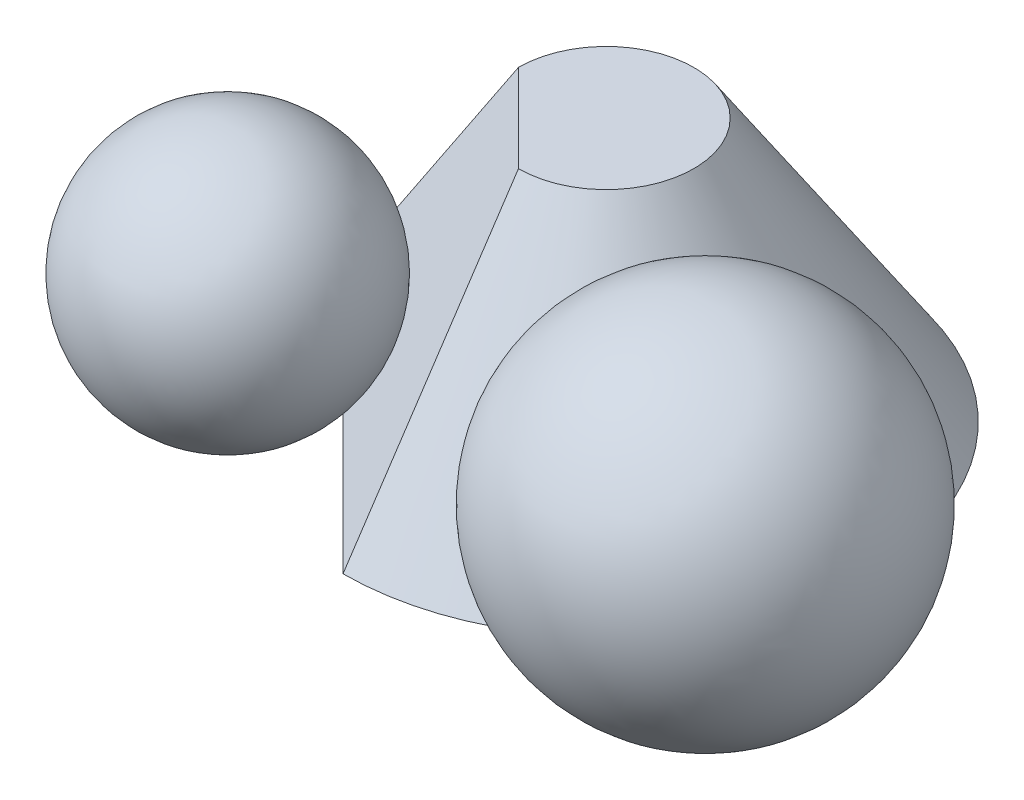
ISO-10303-21;
HEADER;
FILE_DESCRIPTION(('STEP AP214'),'2;1');
FILE_NAME('part.step','',(''),(''),'','','');
FILE_SCHEMA(('AUTOMOTIVE_DESIGN { 1 0 10303 214 1 1 1 1 }'));
ENDSEC;
DATA;
#1=APPLICATION_CONTEXT('core data for automotive mechanical design processes');
#2=APPLICATION_PROTOCOL_DEFINITION('international standard','automotive_design',2000,#1);
#3=PRODUCT_CONTEXT('',#1,'mechanical');
#4=PRODUCT('Part','Part','',(#3));
#5=PRODUCT_RELATED_PRODUCT_CATEGORY('part','',(#4));
#6=PRODUCT_DEFINITION_FORMATION('','',#4);
#7=PRODUCT_DEFINITION_CONTEXT('part definition',#1,'design');
#8=PRODUCT_DEFINITION('design','',#6,#7);
#9=PRODUCT_DEFINITION_SHAPE('','',#8);
#10=(LENGTH_UNIT() NAMED_UNIT(*) SI_UNIT(.MILLI.,.METRE.));
#11=(NAMED_UNIT(*) PLANE_ANGLE_UNIT() SI_UNIT($,.RADIAN.));
#12=(NAMED_UNIT(*) SI_UNIT($,.STERADIAN.) SOLID_ANGLE_UNIT());
#13=UNCERTAINTY_MEASURE_WITH_UNIT(LENGTH_MEASURE(1.E-05),#10,'distance_accuracy_value','');
#14=(GEOMETRIC_REPRESENTATION_CONTEXT(3) GLOBAL_UNCERTAINTY_ASSIGNED_CONTEXT((#13)) GLOBAL_UNIT_ASSIGNED_CONTEXT((#10,
#11,#12)) REPRESENTATION_CONTEXT('',''));
#15=CARTESIAN_POINT('',(0.,0.,0.));
#16=DIRECTION('',(0.,0.,1.));
#17=DIRECTION('',(1.,0.,0.));
#18=AXIS2_PLACEMENT_3D('',#15,#16,#17);
#19=CARTESIAN_POINT('',(50.8589941132433,30.1296581635736,33.9059960754955));
#20=DIRECTION('',(0.,1.,0.));
#21=DIRECTION('',(0.832050294337844,0.,0.554700196225229));
#22=AXIS2_PLACEMENT_3D('',#19,#20,#21);
#23=SPHERICAL_SURFACE('',#22,30.1296581635736);
#24=CARTESIAN_POINT('',(50.8589941132433,60.2593163271471,33.9059960754955));
#25=VERTEX_POINT('',#24);
#26=VERTEX_LOOP('',#25);
#27=FACE_BOUND('',#26,.T.);
#28=ADVANCED_FACE('F42',(#27),#23,.T.);
#29=CLOSED_SHELL('',(#28));
#30=MANIFOLD_SOLID_BREP('B2',#29);
#31=CARTESIAN_POINT('',(-32.3648577860192,22.,32.3648577860192));
#32=DIRECTION('',(0.,1.,0.));
#33=DIRECTION('',(0.707106781186547,0.,-0.707106781186548));
#34=AXIS2_PLACEMENT_3D('',#31,#32,#33);
#35=SPHERICAL_SURFACE('',#34,22.);
#36=CARTESIAN_POINT('',(-32.3648577860192,44.,32.3648577860192));
#37=VERTEX_POINT('',#36);
#38=VERTEX_LOOP('',#37);
#39=FACE_BOUND('',#38,.T.);
#40=ADVANCED_FACE('F63',(#39),#35,.T.);
#41=CLOSED_SHELL('',(#40));
#42=MANIFOLD_SOLID_BREP('B7',#41);
#43=CARTESIAN_POINT('',(0.,0.,0.));
#44=DIRECTION('',(0.,1.,0.));
#45=DIRECTION('',(0.,0.,1.));
#46=AXIS2_PLACEMENT_3D('',#43,#44,#45);
#47=PLANE('',#46);
#48=CARTESIAN_POINT('',(0.,0.,0.));
#49=DIRECTION('',(0.,1.,0.));
#50=DIRECTION('',(0.,0.,1.));
#51=AXIS2_PLACEMENT_3D('',#48,#49,#50);
#52=CIRCLE('',#51,45.);
#53=CARTESIAN_POINT('',(0.,0.,45.));
#54=VERTEX_POINT('',#53);
#55=CARTESIAN_POINT('',(-45.,0.,0.));
#56=VERTEX_POINT('',#55);
#57=EDGE_CURVE('E111',#54,#56,#52,.T.);
#58=ORIENTED_EDGE('',*,*,#57,.F.);
#59=DIRECTION('',(0.707106781186547,0.,0.707106781186547));
#60=VECTOR('',#59,1.);
#61=CARTESIAN_POINT('',(-45.,0.,0.));
#62=LINE('',#61,#60);
#63=EDGE_CURVE('E109',#56,#54,#62,.T.);
#64=ORIENTED_EDGE('',*,*,#63,.F.);
#65=EDGE_LOOP('',(#58,#64));
#66=FACE_BOUND('',#65,.T.);
#67=ADVANCED_FACE('F75',(#66),#47,.F.);
#68=CARTESIAN_POINT('',(0.,45.,0.));
#69=DIRECTION('',(0.,1.,0.));
#70=DIRECTION('',(0.,0.,1.));
#71=AXIS2_PLACEMENT_3D('',#68,#69,#70);
#72=PLANE('',#71);
#73=CARTESIAN_POINT('',(0.,45.,0.));
#74=DIRECTION('',(0.,1.,0.));
#75=DIRECTION('',(0.,0.,1.));
#76=AXIS2_PLACEMENT_3D('',#73,#74,#75);
#77=CIRCLE('',#76,15.);
#78=CARTESIAN_POINT('',(0.,45.,15.));
#79=VERTEX_POINT('',#78);
#80=CARTESIAN_POINT('',(-15.,45.,0.));
#81=VERTEX_POINT('',#80);
#82=EDGE_CURVE('E87',#79,#81,#77,.T.);
#83=ORIENTED_EDGE('',*,*,#82,.T.);
#84=DIRECTION('',(0.707106781186547,0.,0.707106781186547));
#85=VECTOR('',#84,1.);
#86=CARTESIAN_POINT('',(-15.,45.,0.));
#87=LINE('',#86,#85);
#88=EDGE_CURVE('E61',#81,#79,#87,.T.);
#89=ORIENTED_EDGE('',*,*,#88,.T.);
#90=EDGE_LOOP('',(#83,#89));
#91=FACE_BOUND('',#90,.T.);
#92=ADVANCED_FACE('F77',(#91),#72,.T.);
#93=CARTESIAN_POINT('',(0.,45.,0.));
#94=DIRECTION('',(0.,-1.,0.));
#95=DIRECTION('',(0.,0.,-1.));
#96=AXIS2_PLACEMENT_3D('',#93,#94,#95);
#97=CONICAL_SURFACE('',#96,15.,0.588002603547568);
#98=DIRECTION('',(0.,-0.832050294337844,0.554700196225229));
#99=VECTOR('',#98,1.);
#100=CARTESIAN_POINT('',(0.,45.,15.));
#101=LINE('',#100,#99);
#102=EDGE_CURVE('E115',#79,#54,#101,.T.);
#103=ORIENTED_EDGE('',*,*,#102,.T.);
#104=ORIENTED_EDGE('',*,*,#57,.T.);
#105=DIRECTION('',(-0.554700196225229,-0.832050294337844,0.));
#106=VECTOR('',#105,1.);
#107=CARTESIAN_POINT('',(-15.,45.,0.));
#108=LINE('',#107,#106);
#109=EDGE_CURVE('E100',#81,#56,#108,.T.);
#110=ORIENTED_EDGE('',*,*,#109,.F.);
#111=ORIENTED_EDGE('',*,*,#82,.F.);
#112=EDGE_LOOP('',(#103,#104,#110,#111));
#113=FACE_BOUND('',#112,.T.);
#114=ADVANCED_FACE('F123',(#113),#97,.T.);
#115=CARTESIAN_POINT('',(-45.,0.,0.));
#116=DIRECTION('',(-0.639602149066831,0.426401432711221,0.639602149066831));
#117=DIRECTION('',(0.707106781186547,0.,0.707106781186547));
#118=AXIS2_PLACEMENT_3D('',#115,#116,#117);
#119=PLANE('',#118);
#120=ORIENTED_EDGE('',*,*,#109,.T.);
#121=ORIENTED_EDGE('',*,*,#63,.T.);
#122=ORIENTED_EDGE('',*,*,#102,.F.);
#123=ORIENTED_EDGE('',*,*,#88,.F.);
#124=EDGE_LOOP('',(#120,#121,#122,#123));
#125=FACE_BOUND('',#124,.T.);
#126=ADVANCED_FACE('F119',(#125),#119,.T.);
#127=CLOSED_SHELL('',(#67,#92,#114,#126));
#128=MANIFOLD_SOLID_BREP('B38',#127);
#129=ADVANCED_BREP_SHAPE_REPRESENTATION('',(#18,#30,#42,#128),#14);
#130=SHAPE_DEFINITION_REPRESENTATION(#9,#129);
ENDSEC;
END-ISO-10303-21;
